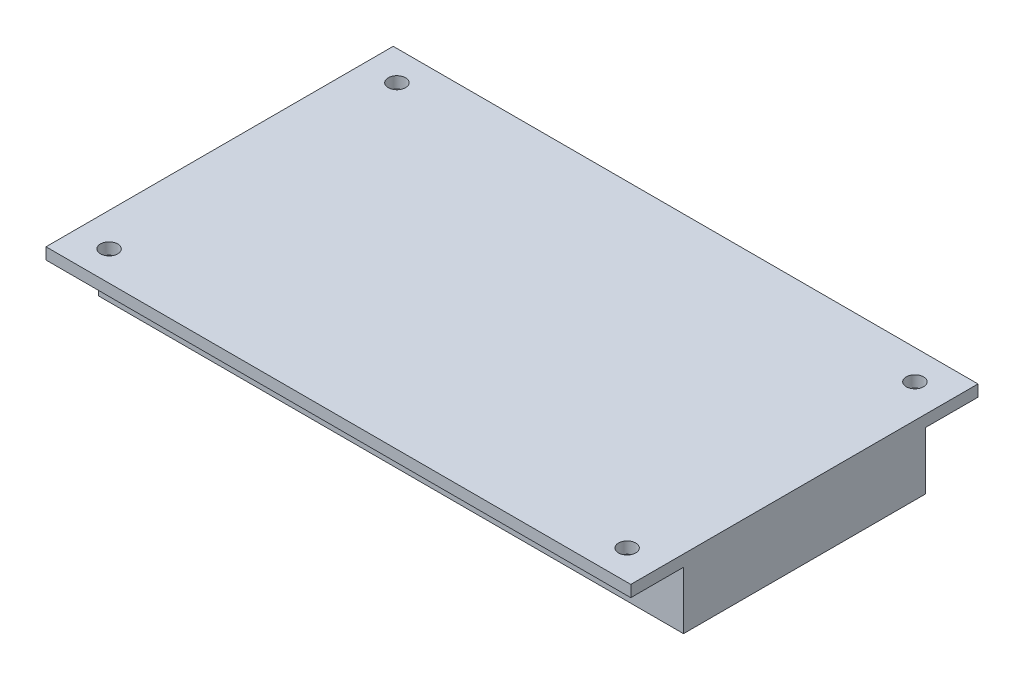
ISO-10303-21;
HEADER;
FILE_DESCRIPTION(('STEP AP214'),'2;1');
FILE_NAME('part.step','',(''),(''),'','','');
FILE_SCHEMA(('AUTOMOTIVE_DESIGN { 1 0 10303 214 1 1 1 1 }'));
ENDSEC;
DATA;
#1=APPLICATION_CONTEXT('core data for automotive mechanical design processes');
#2=APPLICATION_PROTOCOL_DEFINITION('international standard','automotive_design',2000,#1);
#3=PRODUCT_CONTEXT('',#1,'mechanical');
#4=PRODUCT('Part','Part','',(#3));
#5=PRODUCT_RELATED_PRODUCT_CATEGORY('part','',(#4));
#6=PRODUCT_DEFINITION_FORMATION('','',#4);
#7=PRODUCT_DEFINITION_CONTEXT('part definition',#1,'design');
#8=PRODUCT_DEFINITION('design','',#6,#7);
#9=PRODUCT_DEFINITION_SHAPE('','',#8);
#10=(LENGTH_UNIT() NAMED_UNIT(*) SI_UNIT(.MILLI.,.METRE.));
#11=(NAMED_UNIT(*) PLANE_ANGLE_UNIT() SI_UNIT($,.RADIAN.));
#12=(NAMED_UNIT(*) SI_UNIT($,.STERADIAN.) SOLID_ANGLE_UNIT());
#13=UNCERTAINTY_MEASURE_WITH_UNIT(LENGTH_MEASURE(1.E-05),#10,'distance_accuracy_value','');
#14=(GEOMETRIC_REPRESENTATION_CONTEXT(3) GLOBAL_UNCERTAINTY_ASSIGNED_CONTEXT((#13)) GLOBAL_UNIT_ASSIGNED_CONTEXT((#10,
#11,#12)) REPRESENTATION_CONTEXT('',''));
#15=CARTESIAN_POINT('',(0.,0.,0.));
#16=DIRECTION('',(0.,0.,1.));
#17=DIRECTION('',(1.,0.,0.));
#18=AXIS2_PLACEMENT_3D('',#15,#16,#17);
#19=CARTESIAN_POINT('',(-50.8,12.,-30.1625));
#20=DIRECTION('',(1.,0.,0.));
#21=DIRECTION('',(0.,0.,-1.));
#22=AXIS2_PLACEMENT_3D('',#19,#20,#21);
#23=PLANE('',#22);
#24=DIRECTION('',(0.,0.,1.));
#25=VECTOR('',#24,1.);
#26=CARTESIAN_POINT('',(-50.8,10.,-30.1625));
#27=LINE('',#26,#25);
#28=CARTESIAN_POINT('',(-50.8,10.,-30.1625));
#29=VERTEX_POINT('',#28);
#30=CARTESIAN_POINT('',(-50.8,10.,-21.));
#31=VERTEX_POINT('',#30);
#32=EDGE_CURVE('E100',#29,#31,#27,.T.);
#33=ORIENTED_EDGE('',*,*,#32,.T.);
#34=DIRECTION('',(0.,-1.,0.));
#35=VECTOR('',#34,1.);
#36=CARTESIAN_POINT('',(-50.8,0.,-21.));
#37=LINE('',#36,#35);
#38=CARTESIAN_POINT('',(-50.8,0.,-21.));
#39=VERTEX_POINT('',#38);
#40=EDGE_CURVE('E109',#31,#39,#37,.T.);
#41=ORIENTED_EDGE('',*,*,#40,.T.);
#42=DIRECTION('',(0.,0.,1.));
#43=VECTOR('',#42,1.);
#44=CARTESIAN_POINT('',(-50.8,0.,-30.1625));
#45=LINE('',#44,#43);
#46=CARTESIAN_POINT('',(-50.8,0.,21.));
#47=VERTEX_POINT('',#46);
#48=EDGE_CURVE('E57',#39,#47,#45,.T.);
#49=ORIENTED_EDGE('',*,*,#48,.T.);
#50=DIRECTION('',(0.,1.,0.));
#51=VECTOR('',#50,1.);
#52=CARTESIAN_POINT('',(-50.8,0.,21.));
#53=LINE('',#52,#51);
#54=CARTESIAN_POINT('',(-50.8,10.,21.));
#55=VERTEX_POINT('',#54);
#56=EDGE_CURVE('E167',#47,#55,#53,.T.);
#57=ORIENTED_EDGE('',*,*,#56,.T.);
#58=DIRECTION('',(0.,0.,1.));
#59=VECTOR('',#58,1.);
#60=CARTESIAN_POINT('',(-50.8,10.,30.1625));
#61=LINE('',#60,#59);
#62=CARTESIAN_POINT('',(-50.8,10.,30.1625));
#63=VERTEX_POINT('',#62);
#64=EDGE_CURVE('E169',#55,#63,#61,.T.);
#65=ORIENTED_EDGE('',*,*,#64,.T.);
#66=DIRECTION('',(0.,-1.,0.));
#67=VECTOR('',#66,1.);
#68=CARTESIAN_POINT('',(-50.8,12.,30.1625));
#69=LINE('',#68,#67);
#70=CARTESIAN_POINT('',(-50.8,12.,30.1625));
#71=VERTEX_POINT('',#70);
#72=EDGE_CURVE('E11',#71,#63,#69,.T.);
#73=ORIENTED_EDGE('',*,*,#72,.F.);
#74=DIRECTION('',(0.,0.,1.));
#75=VECTOR('',#74,1.);
#76=CARTESIAN_POINT('',(-50.8,12.,-30.1625));
#77=LINE('',#76,#75);
#78=CARTESIAN_POINT('',(-50.8,12.,-30.1625));
#79=VERTEX_POINT('',#78);
#80=EDGE_CURVE('E123',#79,#71,#77,.T.);
#81=ORIENTED_EDGE('',*,*,#80,.F.);
#82=DIRECTION('',(0.,-1.,0.));
#83=VECTOR('',#82,1.);
#84=CARTESIAN_POINT('',(-50.8,12.,-30.1625));
#85=LINE('',#84,#83);
#86=EDGE_CURVE('E116',#79,#29,#85,.T.);
#87=ORIENTED_EDGE('',*,*,#86,.T.);
#88=EDGE_LOOP('',(#33,#41,#49,#57,#65,#73,#81,#87));
#89=FACE_BOUND('',#88,.T.);
#90=ADVANCED_FACE('F33',(#89),#23,.F.);
#91=CARTESIAN_POINT('',(50.8,12.,30.1625));
#92=DIRECTION('',(0.,0.,-1.));
#93=DIRECTION('',(-1.,0.,0.));
#94=AXIS2_PLACEMENT_3D('',#91,#92,#93);
#95=PLANE('',#94);
#96=ORIENTED_EDGE('',*,*,#72,.T.);
#97=DIRECTION('',(1.,0.,0.));
#98=VECTOR('',#97,1.);
#99=CARTESIAN_POINT('',(-50.8,10.,30.1625));
#100=LINE('',#99,#98);
#101=CARTESIAN_POINT('',(50.8,10.,30.1625));
#102=VERTEX_POINT('',#101);
#103=EDGE_CURVE('E177',#63,#102,#100,.T.);
#104=ORIENTED_EDGE('',*,*,#103,.T.);
#105=DIRECTION('',(0.,-1.,0.));
#106=VECTOR('',#105,1.);
#107=CARTESIAN_POINT('',(50.8,12.,30.1625));
#108=LINE('',#107,#106);
#109=CARTESIAN_POINT('',(50.8,12.,30.1625));
#110=VERTEX_POINT('',#109);
#111=EDGE_CURVE('E41',#110,#102,#108,.T.);
#112=ORIENTED_EDGE('',*,*,#111,.F.);
#113=DIRECTION('',(1.,0.,0.));
#114=VECTOR('',#113,1.);
#115=CARTESIAN_POINT('',(50.8,12.,30.1625));
#116=LINE('',#115,#114);
#117=EDGE_CURVE('E184',#71,#110,#116,.T.);
#118=ORIENTED_EDGE('',*,*,#117,.F.);
#119=EDGE_LOOP('',(#96,#104,#112,#118));
#120=FACE_BOUND('',#119,.T.);
#121=ADVANCED_FACE('F201',(#120),#95,.F.);
#122=CARTESIAN_POINT('',(50.8,12.,-30.1625));
#123=DIRECTION('',(-1.,0.,0.));
#124=DIRECTION('',(0.,0.,1.));
#125=AXIS2_PLACEMENT_3D('',#122,#123,#124);
#126=PLANE('',#125);
#127=DIRECTION('',(0.,0.,-1.));
#128=VECTOR('',#127,1.);
#129=CARTESIAN_POINT('',(50.8,0.,-30.1625));
#130=LINE('',#129,#128);
#131=CARTESIAN_POINT('',(50.8,0.,21.));
#132=VERTEX_POINT('',#131);
#133=CARTESIAN_POINT('',(50.8,0.,-21.));
#134=VERTEX_POINT('',#133);
#135=EDGE_CURVE('E130',#132,#134,#130,.T.);
#136=ORIENTED_EDGE('',*,*,#135,.T.);
#137=DIRECTION('',(0.,-1.,0.));
#138=VECTOR('',#137,1.);
#139=CARTESIAN_POINT('',(50.8,0.,-21.));
#140=LINE('',#139,#138);
#141=CARTESIAN_POINT('',(50.8,10.,-21.));
#142=VERTEX_POINT('',#141);
#143=EDGE_CURVE('E49',#142,#134,#140,.T.);
#144=ORIENTED_EDGE('',*,*,#143,.F.);
#145=DIRECTION('',(0.,0.,1.));
#146=VECTOR('',#145,1.);
#147=CARTESIAN_POINT('',(50.8,10.,-30.1625));
#148=LINE('',#147,#146);
#149=CARTESIAN_POINT('',(50.8,10.,-30.1625));
#150=VERTEX_POINT('',#149);
#151=EDGE_CURVE('E138',#150,#142,#148,.T.);
#152=ORIENTED_EDGE('',*,*,#151,.F.);
#153=DIRECTION('',(0.,-1.,0.));
#154=VECTOR('',#153,1.);
#155=CARTESIAN_POINT('',(50.8,12.,-30.1625));
#156=LINE('',#155,#154);
#157=CARTESIAN_POINT('',(50.8,12.,-30.1625));
#158=VERTEX_POINT('',#157);
#159=EDGE_CURVE('E119',#158,#150,#156,.T.);
#160=ORIENTED_EDGE('',*,*,#159,.F.);
#161=DIRECTION('',(0.,0.,-1.));
#162=VECTOR('',#161,1.);
#163=CARTESIAN_POINT('',(50.8,12.,-30.1625));
#164=LINE('',#163,#162);
#165=EDGE_CURVE('E127',#110,#158,#164,.T.);
#166=ORIENTED_EDGE('',*,*,#165,.F.);
#167=ORIENTED_EDGE('',*,*,#111,.T.);
#168=DIRECTION('',(0.,0.,1.));
#169=VECTOR('',#168,1.);
#170=CARTESIAN_POINT('',(50.8,10.,30.1625));
#171=LINE('',#170,#169);
#172=CARTESIAN_POINT('',(50.8,10.,21.));
#173=VERTEX_POINT('',#172);
#174=EDGE_CURVE('E170',#173,#102,#171,.T.);
#175=ORIENTED_EDGE('',*,*,#174,.F.);
#176=DIRECTION('',(0.,1.,0.));
#177=VECTOR('',#176,1.);
#178=CARTESIAN_POINT('',(50.8,0.,21.));
#179=LINE('',#178,#177);
#180=EDGE_CURVE('E165',#132,#173,#179,.T.);
#181=ORIENTED_EDGE('',*,*,#180,.F.);
#182=EDGE_LOOP('',(#136,#144,#152,#160,#166,#167,#175,#181));
#183=FACE_BOUND('',#182,.T.);
#184=ADVANCED_FACE('F190',(#183),#126,.F.);
#185=CARTESIAN_POINT('',(50.8,12.,-30.1625));
#186=DIRECTION('',(0.,0.,1.));
#187=DIRECTION('',(1.,0.,0.));
#188=AXIS2_PLACEMENT_3D('',#185,#186,#187);
#189=PLANE('',#188);
#190=ORIENTED_EDGE('',*,*,#159,.T.);
#191=DIRECTION('',(1.,0.,0.));
#192=VECTOR('',#191,1.);
#193=CARTESIAN_POINT('',(-50.8,10.,-30.1625));
#194=LINE('',#193,#192);
#195=EDGE_CURVE('E104',#29,#150,#194,.T.);
#196=ORIENTED_EDGE('',*,*,#195,.F.);
#197=ORIENTED_EDGE('',*,*,#86,.F.);
#198=DIRECTION('',(-1.,0.,0.));
#199=VECTOR('',#198,1.);
#200=CARTESIAN_POINT('',(50.8,12.,-30.1625));
#201=LINE('',#200,#199);
#202=EDGE_CURVE('E124',#158,#79,#201,.T.);
#203=ORIENTED_EDGE('',*,*,#202,.F.);
#204=EDGE_LOOP('',(#190,#196,#197,#203));
#205=FACE_BOUND('',#204,.T.);
#206=ADVANCED_FACE('F114',(#205),#189,.F.);
#207=CARTESIAN_POINT('',(0.,12.,0.));
#208=DIRECTION('',(0.,-1.,0.));
#209=DIRECTION('',(0.,0.,-1.));
#210=AXIS2_PLACEMENT_3D('',#207,#208,#209);
#211=PLANE('',#210);
#212=CARTESIAN_POINT('',(45.,12.,-25.));
#213=DIRECTION('',(0.,1.,0.));
#214=DIRECTION('',(0.,0.,1.));
#215=AXIS2_PLACEMENT_3D('',#212,#213,#214);
#216=CIRCLE('',#215,1.5);
#217=CARTESIAN_POINT('',(45.,12.,-23.5));
#218=VERTEX_POINT('',#217);
#219=EDGE_CURVE('E155',#218,#218,#216,.T.);
#220=ORIENTED_EDGE('',*,*,#219,.F.);
#221=EDGE_LOOP('',(#220));
#222=FACE_BOUND('',#221,.T.);
#223=CARTESIAN_POINT('',(45.,12.,25.));
#224=DIRECTION('',(0.,1.,0.));
#225=DIRECTION('',(0.,0.,1.));
#226=AXIS2_PLACEMENT_3D('',#223,#224,#225);
#227=CIRCLE('',#226,1.5);
#228=CARTESIAN_POINT('',(45.,12.,26.5));
#229=VERTEX_POINT('',#228);
#230=EDGE_CURVE('E145',#229,#229,#227,.T.);
#231=ORIENTED_EDGE('',*,*,#230,.F.);
#232=EDGE_LOOP('',(#231));
#233=FACE_BOUND('',#232,.T.);
#234=CARTESIAN_POINT('',(-45.,12.,25.));
#235=DIRECTION('',(0.,1.,0.));
#236=DIRECTION('',(0.,0.,1.));
#237=AXIS2_PLACEMENT_3D('',#234,#235,#236);
#238=CIRCLE('',#237,1.5);
#239=CARTESIAN_POINT('',(-45.,12.,26.5));
#240=VERTEX_POINT('',#239);
#241=EDGE_CURVE('E142',#240,#240,#238,.T.);
#242=ORIENTED_EDGE('',*,*,#241,.F.);
#243=EDGE_LOOP('',(#242));
#244=FACE_BOUND('',#243,.T.);
#245=CARTESIAN_POINT('',(-45.,12.,-25.));
#246=DIRECTION('',(0.,1.,0.));
#247=DIRECTION('',(0.,0.,1.));
#248=AXIS2_PLACEMENT_3D('',#245,#246,#247);
#249=CIRCLE('',#248,1.5);
#250=CARTESIAN_POINT('',(-45.,12.,-23.5));
#251=VERTEX_POINT('',#250);
#252=EDGE_CURVE('E139',#251,#251,#249,.T.);
#253=ORIENTED_EDGE('',*,*,#252,.F.);
#254=EDGE_LOOP('',(#253));
#255=FACE_BOUND('',#254,.T.);
#256=ORIENTED_EDGE('',*,*,#80,.T.);
#257=ORIENTED_EDGE('',*,*,#117,.T.);
#258=ORIENTED_EDGE('',*,*,#165,.T.);
#259=ORIENTED_EDGE('',*,*,#202,.T.);
#260=EDGE_LOOP('',(#256,#257,#258,#259));
#261=FACE_BOUND('',#260,.T.);
#262=ADVANCED_FACE('F198',(#222,#233,#244,#255,#261),#211,.F.);
#263=CARTESIAN_POINT('',(0.,0.,0.));
#264=DIRECTION('',(0.,-1.,0.));
#265=DIRECTION('',(0.,0.,-1.));
#266=AXIS2_PLACEMENT_3D('',#263,#264,#265);
#267=PLANE('',#266);
#268=DIRECTION('',(1.,0.,0.));
#269=VECTOR('',#268,1.);
#270=CARTESIAN_POINT('',(-50.8,0.,-21.));
#271=LINE('',#270,#269);
#272=EDGE_CURVE('E163',#39,#134,#271,.T.);
#273=ORIENTED_EDGE('',*,*,#272,.T.);
#274=ORIENTED_EDGE('',*,*,#135,.F.);
#275=DIRECTION('',(1.,0.,0.));
#276=VECTOR('',#275,1.);
#277=CARTESIAN_POINT('',(-50.8,0.,21.));
#278=LINE('',#277,#276);
#279=EDGE_CURVE('E173',#47,#132,#278,.T.);
#280=ORIENTED_EDGE('',*,*,#279,.F.);
#281=ORIENTED_EDGE('',*,*,#48,.F.);
#282=EDGE_LOOP('',(#273,#274,#280,#281));
#283=FACE_BOUND('',#282,.T.);
#284=ADVANCED_FACE('F194',(#283),#267,.T.);
#285=CARTESIAN_POINT('',(-50.8,10.,30.1625));
#286=DIRECTION('',(0.,1.,0.));
#287=DIRECTION('',(0.,0.,1.));
#288=AXIS2_PLACEMENT_3D('',#285,#286,#287);
#289=PLANE('',#288);
#290=CARTESIAN_POINT('',(45.,10.,25.));
#291=DIRECTION('',(0.,1.,0.));
#292=DIRECTION('',(0.,0.,1.));
#293=AXIS2_PLACEMENT_3D('',#290,#291,#292);
#294=CIRCLE('',#293,1.5);
#295=CARTESIAN_POINT('',(45.,10.,26.5));
#296=VERTEX_POINT('',#295);
#297=EDGE_CURVE('E143',#296,#296,#294,.T.);
#298=ORIENTED_EDGE('',*,*,#297,.T.);
#299=EDGE_LOOP('',(#298));
#300=FACE_BOUND('',#299,.T.);
#301=CARTESIAN_POINT('',(-45.,10.,25.));
#302=DIRECTION('',(0.,1.,0.));
#303=DIRECTION('',(0.,0.,1.));
#304=AXIS2_PLACEMENT_3D('',#301,#302,#303);
#305=CIRCLE('',#304,1.5);
#306=CARTESIAN_POINT('',(-45.,10.,26.5));
#307=VERTEX_POINT('',#306);
#308=EDGE_CURVE('E140',#307,#307,#305,.T.);
#309=ORIENTED_EDGE('',*,*,#308,.T.);
#310=EDGE_LOOP('',(#309));
#311=FACE_BOUND('',#310,.T.);
#312=ORIENTED_EDGE('',*,*,#174,.T.);
#313=ORIENTED_EDGE('',*,*,#103,.F.);
#314=ORIENTED_EDGE('',*,*,#64,.F.);
#315=DIRECTION('',(1.,0.,0.));
#316=VECTOR('',#315,1.);
#317=CARTESIAN_POINT('',(-50.8,10.,21.));
#318=LINE('',#317,#316);
#319=EDGE_CURVE('E180',#55,#173,#318,.T.);
#320=ORIENTED_EDGE('',*,*,#319,.T.);
#321=EDGE_LOOP('',(#312,#313,#314,#320));
#322=FACE_BOUND('',#321,.T.);
#323=ADVANCED_FACE('F203',(#300,#311,#322),#289,.F.);
#324=CARTESIAN_POINT('',(-50.8,0.,21.));
#325=DIRECTION('',(0.,0.,-1.));
#326=DIRECTION('',(-1.,0.,0.));
#327=AXIS2_PLACEMENT_3D('',#324,#325,#326);
#328=PLANE('',#327);
#329=ORIENTED_EDGE('',*,*,#180,.T.);
#330=ORIENTED_EDGE('',*,*,#319,.F.);
#331=ORIENTED_EDGE('',*,*,#56,.F.);
#332=ORIENTED_EDGE('',*,*,#279,.T.);
#333=EDGE_LOOP('',(#329,#330,#331,#332));
#334=FACE_BOUND('',#333,.T.);
#335=ADVANCED_FACE('F206',(#334),#328,.F.);
#336=CARTESIAN_POINT('',(-50.8,0.,-21.));
#337=DIRECTION('',(0.,0.,1.));
#338=DIRECTION('',(1.,0.,0.));
#339=AXIS2_PLACEMENT_3D('',#336,#337,#338);
#340=PLANE('',#339);
#341=ORIENTED_EDGE('',*,*,#143,.T.);
#342=ORIENTED_EDGE('',*,*,#272,.F.);
#343=ORIENTED_EDGE('',*,*,#40,.F.);
#344=DIRECTION('',(1.,0.,0.));
#345=VECTOR('',#344,1.);
#346=CARTESIAN_POINT('',(-50.8,10.,-21.));
#347=LINE('',#346,#345);
#348=EDGE_CURVE('E106',#31,#142,#347,.T.);
#349=ORIENTED_EDGE('',*,*,#348,.T.);
#350=EDGE_LOOP('',(#341,#342,#343,#349));
#351=FACE_BOUND('',#350,.T.);
#352=ADVANCED_FACE('F195',(#351),#340,.F.);
#353=CARTESIAN_POINT('',(-50.8,10.,-30.1625));
#354=DIRECTION('',(0.,1.,0.));
#355=DIRECTION('',(0.,0.,1.));
#356=AXIS2_PLACEMENT_3D('',#353,#354,#355);
#357=PLANE('',#356);
#358=CARTESIAN_POINT('',(45.,10.,-25.));
#359=DIRECTION('',(0.,1.,0.));
#360=DIRECTION('',(0.,0.,1.));
#361=AXIS2_PLACEMENT_3D('',#358,#359,#360);
#362=CIRCLE('',#361,1.5);
#363=CARTESIAN_POINT('',(45.,10.,-23.5));
#364=VERTEX_POINT('',#363);
#365=EDGE_CURVE('E36',#364,#364,#362,.T.);
#366=ORIENTED_EDGE('',*,*,#365,.T.);
#367=EDGE_LOOP('',(#366));
#368=FACE_BOUND('',#367,.T.);
#369=CARTESIAN_POINT('',(-45.,10.,-25.));
#370=DIRECTION('',(0.,1.,0.));
#371=DIRECTION('',(0.,0.,1.));
#372=AXIS2_PLACEMENT_3D('',#369,#370,#371);
#373=CIRCLE('',#372,1.5);
#374=CARTESIAN_POINT('',(-45.,10.,-23.5));
#375=VERTEX_POINT('',#374);
#376=EDGE_CURVE('E135',#375,#375,#373,.T.);
#377=ORIENTED_EDGE('',*,*,#376,.T.);
#378=EDGE_LOOP('',(#377));
#379=FACE_BOUND('',#378,.T.);
#380=ORIENTED_EDGE('',*,*,#151,.T.);
#381=ORIENTED_EDGE('',*,*,#348,.F.);
#382=ORIENTED_EDGE('',*,*,#32,.F.);
#383=ORIENTED_EDGE('',*,*,#195,.T.);
#384=EDGE_LOOP('',(#380,#381,#382,#383));
#385=FACE_BOUND('',#384,.T.);
#386=ADVANCED_FACE('F103',(#368,#379,#385),#357,.F.);
#387=CARTESIAN_POINT('',(-45.,0.,-25.));
#388=DIRECTION('',(0.,1.,0.));
#389=DIRECTION('',(0.,0.,1.));
#390=AXIS2_PLACEMENT_3D('',#387,#388,#389);
#391=CYLINDRICAL_SURFACE('',#390,1.5);
#392=ORIENTED_EDGE('',*,*,#252,.T.);
#393=EDGE_LOOP('',(#392));
#394=FACE_BOUND('',#393,.T.);
#395=ORIENTED_EDGE('',*,*,#376,.F.);
#396=EDGE_LOOP('',(#395));
#397=FACE_BOUND('',#396,.T.);
#398=ADVANCED_FACE('F240',(#394,#397),#391,.F.);
#399=CARTESIAN_POINT('',(-45.,0.,25.));
#400=DIRECTION('',(0.,1.,0.));
#401=DIRECTION('',(0.,0.,1.));
#402=AXIS2_PLACEMENT_3D('',#399,#400,#401);
#403=CYLINDRICAL_SURFACE('',#402,1.5);
#404=ORIENTED_EDGE('',*,*,#241,.T.);
#405=EDGE_LOOP('',(#404));
#406=FACE_BOUND('',#405,.T.);
#407=ORIENTED_EDGE('',*,*,#308,.F.);
#408=EDGE_LOOP('',(#407));
#409=FACE_BOUND('',#408,.T.);
#410=ADVANCED_FACE('F243',(#406,#409),#403,.F.);
#411=CARTESIAN_POINT('',(45.,0.,25.));
#412=DIRECTION('',(0.,1.,0.));
#413=DIRECTION('',(0.,0.,1.));
#414=AXIS2_PLACEMENT_3D('',#411,#412,#413);
#415=CYLINDRICAL_SURFACE('',#414,1.5);
#416=ORIENTED_EDGE('',*,*,#230,.T.);
#417=EDGE_LOOP('',(#416));
#418=FACE_BOUND('',#417,.T.);
#419=ORIENTED_EDGE('',*,*,#297,.F.);
#420=EDGE_LOOP('',(#419));
#421=FACE_BOUND('',#420,.T.);
#422=ADVANCED_FACE('F255',(#418,#421),#415,.F.);
#423=CARTESIAN_POINT('',(45.,0.,-25.));
#424=DIRECTION('',(0.,1.,0.));
#425=DIRECTION('',(0.,0.,1.));
#426=AXIS2_PLACEMENT_3D('',#423,#424,#425);
#427=CYLINDRICAL_SURFACE('',#426,1.5);
#428=ORIENTED_EDGE('',*,*,#219,.T.);
#429=EDGE_LOOP('',(#428));
#430=FACE_BOUND('',#429,.T.);
#431=ORIENTED_EDGE('',*,*,#365,.F.);
#432=EDGE_LOOP('',(#431));
#433=FACE_BOUND('',#432,.T.);
#434=ADVANCED_FACE('F259',(#430,#433),#427,.F.);
#435=CLOSED_SHELL('',(#90,#121,#184,#206,#262,#284,#323,#335,#352,#386,#398,#410,#422,#434));
#436=MANIFOLD_SOLID_BREP('B2',#435);
#437=ADVANCED_BREP_SHAPE_REPRESENTATION('',(#18,#436),#14);
#438=SHAPE_DEFINITION_REPRESENTATION(#9,#437);
ENDSEC;
END-ISO-10303-21;
